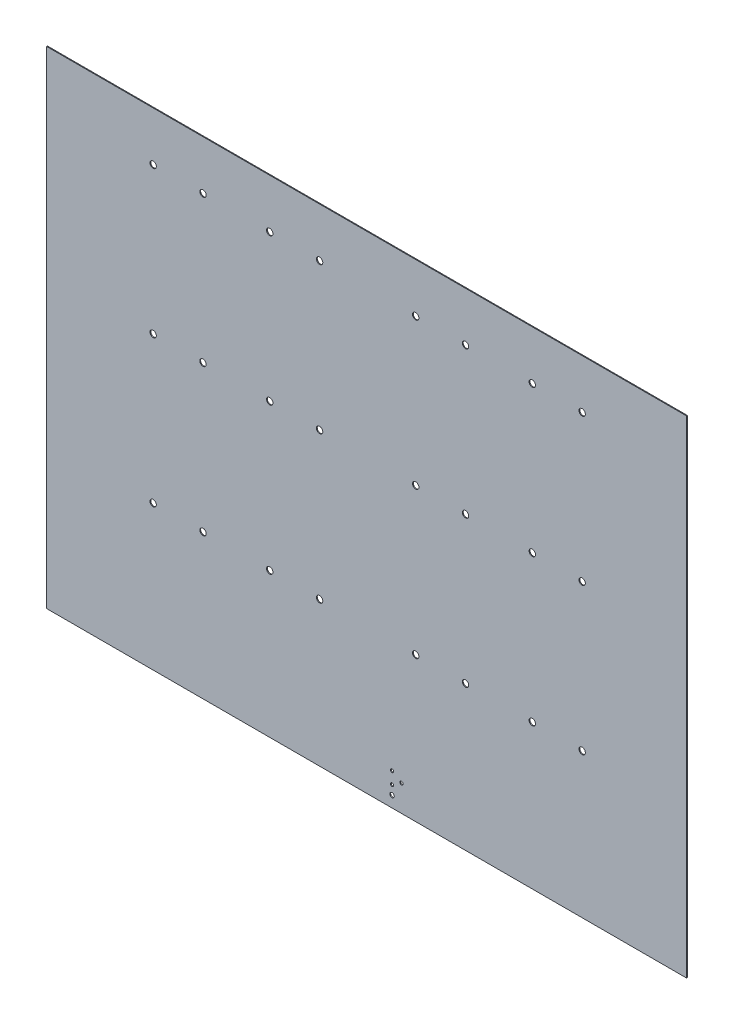
ISO-10303-21;
HEADER;
FILE_DESCRIPTION(('STEP AP214'),'2;1');
FILE_NAME('part.step','',(''),(''),'','','');
FILE_SCHEMA(('AUTOMOTIVE_DESIGN { 1 0 10303 214 1 1 1 1 }'));
ENDSEC;
DATA;
#1=APPLICATION_CONTEXT('core data for automotive mechanical design processes');
#2=APPLICATION_PROTOCOL_DEFINITION('international standard','automotive_design',2000,#1);
#3=PRODUCT_CONTEXT('',#1,'mechanical');
#4=PRODUCT('Part','Part','',(#3));
#5=PRODUCT_RELATED_PRODUCT_CATEGORY('part','',(#4));
#6=PRODUCT_DEFINITION_FORMATION('','',#4);
#7=PRODUCT_DEFINITION_CONTEXT('part definition',#1,'design');
#8=PRODUCT_DEFINITION('design','',#6,#7);
#9=PRODUCT_DEFINITION_SHAPE('','',#8);
#10=(LENGTH_UNIT() NAMED_UNIT(*) SI_UNIT(.MILLI.,.METRE.));
#11=(NAMED_UNIT(*) PLANE_ANGLE_UNIT() SI_UNIT($,.RADIAN.));
#12=(NAMED_UNIT(*) SI_UNIT($,.STERADIAN.) SOLID_ANGLE_UNIT());
#13=UNCERTAINTY_MEASURE_WITH_UNIT(LENGTH_MEASURE(1.E-05),#10,'distance_accuracy_value','');
#14=(GEOMETRIC_REPRESENTATION_CONTEXT(3) GLOBAL_UNCERTAINTY_ASSIGNED_CONTEXT((#13)) GLOBAL_UNIT_ASSIGNED_CONTEXT((#10,
#11,#12)) REPRESENTATION_CONTEXT('',''));
#15=CARTESIAN_POINT('',(0.,0.,0.));
#16=DIRECTION('',(0.,0.,1.));
#17=DIRECTION('',(1.,0.,0.));
#18=AXIS2_PLACEMENT_3D('',#15,#16,#17);
#19=CARTESIAN_POINT('',(50.8,50.8,0.));
#20=DIRECTION('',(0.,0.,-1.));
#21=DIRECTION('',(-1.,0.,0.));
#22=AXIS2_PLACEMENT_3D('',#19,#20,#21);
#23=PLANE('',#22);
#24=CARTESIAN_POINT('',(317.5889,268.8971,0.));
#25=DIRECTION('',(0.,0.,-1.));
#26=DIRECTION('',(-1.,0.,0.));
#27=AXIS2_PLACEMENT_3D('',#24,#25,#26);
#28=CIRCLE('',#27,1.5875);
#29=CARTESIAN_POINT('',(316.0014,268.8971,0.));
#30=VERTEX_POINT('',#29);
#31=EDGE_CURVE('E161',#30,#30,#28,.F.);
#32=ORIENTED_EDGE('',*,*,#31,.T.);
#33=EDGE_LOOP('',(#32));
#34=FACE_BOUND('',#33,.T.);
#35=CARTESIAN_POINT('',(292.7477,268.8971,0.));
#36=DIRECTION('',(0.,0.,-1.));
#37=DIRECTION('',(-1.,0.,0.));
#38=AXIS2_PLACEMENT_3D('',#35,#36,#37);
#39=CIRCLE('',#38,1.5875);
#40=CARTESIAN_POINT('',(291.1602,268.8971,0.));
#41=VERTEX_POINT('',#40);
#42=EDGE_CURVE('E164',#41,#41,#39,.F.);
#43=ORIENTED_EDGE('',*,*,#42,.T.);
#44=EDGE_LOOP('',(#43));
#45=FACE_BOUND('',#44,.T.);
#46=CARTESIAN_POINT('',(317.5889,195.8721,0.));
#47=DIRECTION('',(0.,0.,-1.));
#48=DIRECTION('',(-1.,0.,0.));
#49=AXIS2_PLACEMENT_3D('',#46,#47,#48);
#50=CIRCLE('',#49,1.5875);
#51=CARTESIAN_POINT('',(316.0014,195.8721,0.));
#52=VERTEX_POINT('',#51);
#53=EDGE_CURVE('E167',#52,#52,#50,.F.);
#54=ORIENTED_EDGE('',*,*,#53,.T.);
#55=EDGE_LOOP('',(#54));
#56=FACE_BOUND('',#55,.T.);
#57=CARTESIAN_POINT('',(292.7477,195.8721,0.));
#58=DIRECTION('',(0.,0.,-1.));
#59=DIRECTION('',(-1.,0.,0.));
#60=AXIS2_PLACEMENT_3D('',#57,#58,#59);
#61=CIRCLE('',#60,1.5875);
#62=CARTESIAN_POINT('',(291.1602,195.8721,0.));
#63=VERTEX_POINT('',#62);
#64=EDGE_CURVE('E170',#63,#63,#61,.F.);
#65=ORIENTED_EDGE('',*,*,#64,.T.);
#66=EDGE_LOOP('',(#65));
#67=FACE_BOUND('',#66,.T.);
#68=CARTESIAN_POINT('',(259.49402,268.8971,0.));
#69=DIRECTION('',(0.,0.,-1.));
#70=DIRECTION('',(-1.,0.,0.));
#71=AXIS2_PLACEMENT_3D('',#68,#69,#70);
#72=CIRCLE('',#71,1.5875);
#73=CARTESIAN_POINT('',(257.90652,268.8971,0.));
#74=VERTEX_POINT('',#73);
#75=EDGE_CURVE('E173',#74,#74,#72,.F.);
#76=ORIENTED_EDGE('',*,*,#75,.T.);
#77=EDGE_LOOP('',(#76));
#78=FACE_BOUND('',#77,.T.);
#79=CARTESIAN_POINT('',(234.65282,268.8971,0.));
#80=DIRECTION('',(0.,0.,-1.));
#81=DIRECTION('',(-1.,0.,0.));
#82=AXIS2_PLACEMENT_3D('',#79,#80,#81);
#83=CIRCLE('',#82,1.5875);
#84=CARTESIAN_POINT('',(233.06532,268.8971,0.));
#85=VERTEX_POINT('',#84);
#86=EDGE_CURVE('E176',#85,#85,#83,.F.);
#87=ORIENTED_EDGE('',*,*,#86,.T.);
#88=EDGE_LOOP('',(#87));
#89=FACE_BOUND('',#88,.T.);
#90=CARTESIAN_POINT('',(259.49402,195.8721,0.));
#91=DIRECTION('',(0.,0.,-1.));
#92=DIRECTION('',(-1.,0.,0.));
#93=AXIS2_PLACEMENT_3D('',#90,#91,#92);
#94=CIRCLE('',#93,1.5875);
#95=CARTESIAN_POINT('',(257.90652,195.8721,0.));
#96=VERTEX_POINT('',#95);
#97=EDGE_CURVE('E179',#96,#96,#94,.F.);
#98=ORIENTED_EDGE('',*,*,#97,.T.);
#99=EDGE_LOOP('',(#98));
#100=FACE_BOUND('',#99,.T.);
#101=CARTESIAN_POINT('',(259.49402,122.8471,0.));
#102=DIRECTION('',(0.,0.,-1.));
#103=DIRECTION('',(-1.,0.,0.));
#104=AXIS2_PLACEMENT_3D('',#101,#102,#103);
#105=CIRCLE('',#104,1.5875);
#106=CARTESIAN_POINT('',(257.90652,122.8471,0.));
#107=VERTEX_POINT('',#106);
#108=EDGE_CURVE('E182',#107,#107,#105,.F.);
#109=ORIENTED_EDGE('',*,*,#108,.T.);
#110=EDGE_LOOP('',(#109));
#111=FACE_BOUND('',#110,.T.);
#112=CARTESIAN_POINT('',(234.65282,195.8721,0.));
#113=DIRECTION('',(0.,0.,-1.));
#114=DIRECTION('',(-1.,0.,0.));
#115=AXIS2_PLACEMENT_3D('',#112,#113,#114);
#116=CIRCLE('',#115,1.5875);
#117=CARTESIAN_POINT('',(233.06532,195.8721,0.));
#118=VERTEX_POINT('',#117);
#119=EDGE_CURVE('E185',#118,#118,#116,.F.);
#120=ORIENTED_EDGE('',*,*,#119,.T.);
#121=EDGE_LOOP('',(#120));
#122=FACE_BOUND('',#121,.T.);
#123=CARTESIAN_POINT('',(317.5889,122.8471,0.));
#124=DIRECTION('',(0.,0.,-1.));
#125=DIRECTION('',(-1.,0.,0.));
#126=AXIS2_PLACEMENT_3D('',#123,#124,#125);
#127=CIRCLE('',#126,1.5875);
#128=CARTESIAN_POINT('',(316.0014,122.8471,0.));
#129=VERTEX_POINT('',#128);
#130=EDGE_CURVE('E188',#129,#129,#127,.F.);
#131=ORIENTED_EDGE('',*,*,#130,.T.);
#132=EDGE_LOOP('',(#131));
#133=FACE_BOUND('',#132,.T.);
#134=CARTESIAN_POINT('',(292.7477,122.8471,0.));
#135=DIRECTION('',(0.,0.,-1.));
#136=DIRECTION('',(-1.,0.,0.));
#137=AXIS2_PLACEMENT_3D('',#134,#135,#136);
#138=CIRCLE('',#137,1.5875);
#139=CARTESIAN_POINT('',(291.1602,122.8471,0.));
#140=VERTEX_POINT('',#139);
#141=EDGE_CURVE('E191',#140,#140,#138,.F.);
#142=ORIENTED_EDGE('',*,*,#141,.T.);
#143=EDGE_LOOP('',(#142));
#144=FACE_BOUND('',#143,.T.);
#145=CARTESIAN_POINT('',(234.65282,122.8471,0.));
#146=DIRECTION('',(0.,0.,-1.));
#147=DIRECTION('',(-1.,0.,0.));
#148=AXIS2_PLACEMENT_3D('',#145,#146,#147);
#149=CIRCLE('',#148,1.5875);
#150=CARTESIAN_POINT('',(233.06532,122.8471,0.));
#151=VERTEX_POINT('',#150);
#152=EDGE_CURVE('E194',#151,#151,#149,.F.);
#153=ORIENTED_EDGE('',*,*,#152,.T.);
#154=EDGE_LOOP('',(#153));
#155=FACE_BOUND('',#154,.T.);
#156=CARTESIAN_POINT('',(227.5713,63.881,0.));
#157=DIRECTION('',(0.,0.,-1.));
#158=DIRECTION('',(-1.,0.,0.));
#159=AXIS2_PLACEMENT_3D('',#156,#157,#158);
#160=CIRCLE('',#159,0.8001);
#161=CARTESIAN_POINT('',(226.7712,63.881,0.));
#162=VERTEX_POINT('',#161);
#163=EDGE_CURVE('E197',#162,#162,#160,.F.);
#164=ORIENTED_EDGE('',*,*,#163,.T.);
#165=EDGE_LOOP('',(#164));
#166=FACE_BOUND('',#165,.T.);
#167=CARTESIAN_POINT('',(222.8723,60.8838,0.));
#168=DIRECTION('',(0.,0.,-1.));
#169=DIRECTION('',(-1.,0.,0.));
#170=AXIS2_PLACEMENT_3D('',#167,#168,#169);
#171=CIRCLE('',#170,0.8001);
#172=CARTESIAN_POINT('',(222.0722,60.8838,0.));
#173=VERTEX_POINT('',#172);
#174=EDGE_CURVE('E200',#173,#173,#171,.F.);
#175=ORIENTED_EDGE('',*,*,#174,.T.);
#176=EDGE_LOOP('',(#175));
#177=FACE_BOUND('',#176,.T.);
#178=CARTESIAN_POINT('',(186.77255,268.8971,0.));
#179=DIRECTION('',(0.,0.,-1.));
#180=DIRECTION('',(-1.,0.,0.));
#181=AXIS2_PLACEMENT_3D('',#178,#179,#180);
#182=CIRCLE('',#181,1.5875);
#183=CARTESIAN_POINT('',(185.18505,268.8971,0.));
#184=VERTEX_POINT('',#183);
#185=EDGE_CURVE('E203',#184,#184,#182,.F.);
#186=ORIENTED_EDGE('',*,*,#185,.T.);
#187=EDGE_LOOP('',(#186));
#188=FACE_BOUND('',#187,.T.);
#189=CARTESIAN_POINT('',(161.93135,268.8971,0.));
#190=DIRECTION('',(0.,0.,-1.));
#191=DIRECTION('',(-1.,0.,0.));
#192=AXIS2_PLACEMENT_3D('',#189,#190,#191);
#193=CIRCLE('',#192,1.5875);
#194=CARTESIAN_POINT('',(160.34385,268.8971,0.));
#195=VERTEX_POINT('',#194);
#196=EDGE_CURVE('E206',#195,#195,#193,.F.);
#197=ORIENTED_EDGE('',*,*,#196,.T.);
#198=EDGE_LOOP('',(#197));
#199=FACE_BOUND('',#198,.T.);
#200=CARTESIAN_POINT('',(186.77255,195.8721,0.));
#201=DIRECTION('',(0.,0.,-1.));
#202=DIRECTION('',(-1.,0.,0.));
#203=AXIS2_PLACEMENT_3D('',#200,#201,#202);
#204=CIRCLE('',#203,1.5875);
#205=CARTESIAN_POINT('',(185.18505,195.8721,0.));
#206=VERTEX_POINT('',#205);
#207=EDGE_CURVE('E209',#206,#206,#204,.F.);
#208=ORIENTED_EDGE('',*,*,#207,.T.);
#209=EDGE_LOOP('',(#208));
#210=FACE_BOUND('',#209,.T.);
#211=CARTESIAN_POINT('',(161.93135,195.8721,0.));
#212=DIRECTION('',(0.,0.,-1.));
#213=DIRECTION('',(-1.,0.,0.));
#214=AXIS2_PLACEMENT_3D('',#211,#212,#213);
#215=CIRCLE('',#214,1.5875);
#216=CARTESIAN_POINT('',(160.34385,195.8721,0.));
#217=VERTEX_POINT('',#216);
#218=EDGE_CURVE('E212',#217,#217,#215,.F.);
#219=ORIENTED_EDGE('',*,*,#218,.T.);
#220=EDGE_LOOP('',(#219));
#221=FACE_BOUND('',#220,.T.);
#222=CARTESIAN_POINT('',(128.67767,268.8971,0.));
#223=DIRECTION('',(0.,0.,-1.));
#224=DIRECTION('',(-1.,0.,0.));
#225=AXIS2_PLACEMENT_3D('',#222,#223,#224);
#226=CIRCLE('',#225,1.5875);
#227=CARTESIAN_POINT('',(127.09017,268.8971,0.));
#228=VERTEX_POINT('',#227);
#229=EDGE_CURVE('E215',#228,#228,#226,.F.);
#230=ORIENTED_EDGE('',*,*,#229,.T.);
#231=EDGE_LOOP('',(#230));
#232=FACE_BOUND('',#231,.T.);
#233=CARTESIAN_POINT('',(103.83647,268.8971,0.));
#234=DIRECTION('',(0.,0.,-1.));
#235=DIRECTION('',(-1.,0.,0.));
#236=AXIS2_PLACEMENT_3D('',#233,#234,#235);
#237=CIRCLE('',#236,1.5875);
#238=CARTESIAN_POINT('',(102.24897,268.8971,0.));
#239=VERTEX_POINT('',#238);
#240=EDGE_CURVE('E218',#239,#239,#237,.F.);
#241=ORIENTED_EDGE('',*,*,#240,.T.);
#242=EDGE_LOOP('',(#241));
#243=FACE_BOUND('',#242,.T.);
#244=CARTESIAN_POINT('',(128.67767,195.8721,0.));
#245=DIRECTION('',(0.,0.,-1.));
#246=DIRECTION('',(-1.,0.,0.));
#247=AXIS2_PLACEMENT_3D('',#244,#245,#246);
#248=CIRCLE('',#247,1.5875);
#249=CARTESIAN_POINT('',(127.09017,195.8721,0.));
#250=VERTEX_POINT('',#249);
#251=EDGE_CURVE('E221',#250,#250,#248,.F.);
#252=ORIENTED_EDGE('',*,*,#251,.T.);
#253=EDGE_LOOP('',(#252));
#254=FACE_BOUND('',#253,.T.);
#255=CARTESIAN_POINT('',(186.77255,122.8471,0.));
#256=DIRECTION('',(0.,0.,-1.));
#257=DIRECTION('',(-1.,0.,0.));
#258=AXIS2_PLACEMENT_3D('',#255,#256,#257);
#259=CIRCLE('',#258,1.5875);
#260=CARTESIAN_POINT('',(185.18505,122.8471,0.));
#261=VERTEX_POINT('',#260);
#262=EDGE_CURVE('E224',#261,#261,#259,.F.);
#263=ORIENTED_EDGE('',*,*,#262,.T.);
#264=EDGE_LOOP('',(#263));
#265=FACE_BOUND('',#264,.T.);
#266=CARTESIAN_POINT('',(161.93135,122.8471,0.));
#267=DIRECTION('',(0.,0.,-1.));
#268=DIRECTION('',(-1.,0.,0.));
#269=AXIS2_PLACEMENT_3D('',#266,#267,#268);
#270=CIRCLE('',#269,1.5875);
#271=CARTESIAN_POINT('',(160.34385,122.8471,0.));
#272=VERTEX_POINT('',#271);
#273=EDGE_CURVE('E227',#272,#272,#270,.F.);
#274=ORIENTED_EDGE('',*,*,#273,.T.);
#275=EDGE_LOOP('',(#274));
#276=FACE_BOUND('',#275,.T.);
#277=CARTESIAN_POINT('',(222.8723,66.8782,0.));
#278=DIRECTION('',(0.,0.,-1.));
#279=DIRECTION('',(-1.,0.,0.));
#280=AXIS2_PLACEMENT_3D('',#277,#278,#279);
#281=CIRCLE('',#280,0.8001);
#282=CARTESIAN_POINT('',(222.0722,66.8782,0.));
#283=VERTEX_POINT('',#282);
#284=EDGE_CURVE('E230',#283,#283,#281,.F.);
#285=ORIENTED_EDGE('',*,*,#284,.T.);
#286=EDGE_LOOP('',(#285));
#287=FACE_BOUND('',#286,.T.);
#288=CARTESIAN_POINT('',(222.8723,56.3626,0.));
#289=DIRECTION('',(0.,0.,-1.));
#290=DIRECTION('',(-1.,0.,0.));
#291=AXIS2_PLACEMENT_3D('',#288,#289,#290);
#292=CIRCLE('',#291,1.1049);
#293=CARTESIAN_POINT('',(221.7674,56.3626,0.));
#294=VERTEX_POINT('',#293);
#295=EDGE_CURVE('E233',#294,#294,#292,.F.);
#296=ORIENTED_EDGE('',*,*,#295,.T.);
#297=EDGE_LOOP('',(#296));
#298=FACE_BOUND('',#297,.T.);
#299=CARTESIAN_POINT('',(128.67767,122.8471,0.));
#300=DIRECTION('',(0.,0.,-1.));
#301=DIRECTION('',(-1.,0.,0.));
#302=AXIS2_PLACEMENT_3D('',#299,#300,#301);
#303=CIRCLE('',#302,1.5875);
#304=CARTESIAN_POINT('',(127.09017,122.8471,0.));
#305=VERTEX_POINT('',#304);
#306=EDGE_CURVE('E236',#305,#305,#303,.F.);
#307=ORIENTED_EDGE('',*,*,#306,.T.);
#308=EDGE_LOOP('',(#307));
#309=FACE_BOUND('',#308,.T.);
#310=CARTESIAN_POINT('',(103.83647,195.8721,0.));
#311=DIRECTION('',(0.,0.,-1.));
#312=DIRECTION('',(-1.,0.,0.));
#313=AXIS2_PLACEMENT_3D('',#310,#311,#312);
#314=CIRCLE('',#313,1.5875);
#315=CARTESIAN_POINT('',(102.24897,195.8721,0.));
#316=VERTEX_POINT('',#315);
#317=EDGE_CURVE('E238',#316,#316,#314,.F.);
#318=ORIENTED_EDGE('',*,*,#317,.T.);
#319=EDGE_LOOP('',(#318));
#320=FACE_BOUND('',#319,.T.);
#321=CARTESIAN_POINT('',(103.83647,122.8471,0.));
#322=DIRECTION('',(0.,0.,-1.));
#323=DIRECTION('',(-1.,0.,0.));
#324=AXIS2_PLACEMENT_3D('',#321,#322,#323);
#325=CIRCLE('',#324,1.5875);
#326=CARTESIAN_POINT('',(102.24897,122.8471,0.));
#327=VERTEX_POINT('',#326);
#328=EDGE_CURVE('E20',#327,#327,#325,.F.);
#329=ORIENTED_EDGE('',*,*,#328,.T.);
#330=EDGE_LOOP('',(#329));
#331=FACE_BOUND('',#330,.T.);
#332=DIRECTION('',(0.,1.,0.));
#333=VECTOR('',#332,1.);
#334=CARTESIAN_POINT('',(369.57,50.8,0.));
#335=LINE('',#334,#333);
#336=CARTESIAN_POINT('',(369.57,293.37,0.));
#337=VERTEX_POINT('',#336);
#338=CARTESIAN_POINT('',(369.57,50.8,0.));
#339=VERTEX_POINT('',#338);
#340=EDGE_CURVE('E252',#337,#339,#335,.F.);
#341=ORIENTED_EDGE('',*,*,#340,.T.);
#342=DIRECTION('',(1.,0.,0.));
#343=VECTOR('',#342,1.);
#344=CARTESIAN_POINT('',(50.8,50.8,0.));
#345=LINE('',#344,#343);
#346=CARTESIAN_POINT('',(50.8,50.8,0.));
#347=VERTEX_POINT('',#346);
#348=EDGE_CURVE('E60',#339,#347,#345,.F.);
#349=ORIENTED_EDGE('',*,*,#348,.T.);
#350=DIRECTION('',(0.,1.,0.));
#351=VECTOR('',#350,1.);
#352=CARTESIAN_POINT('',(50.8,293.37,0.));
#353=LINE('',#352,#351);
#354=CARTESIAN_POINT('',(50.8,293.37,0.));
#355=VERTEX_POINT('',#354);
#356=EDGE_CURVE('E59',#347,#355,#353,.T.);
#357=ORIENTED_EDGE('',*,*,#356,.T.);
#358=DIRECTION('',(1.,0.,0.));
#359=VECTOR('',#358,1.);
#360=CARTESIAN_POINT('',(369.57,293.37,0.));
#361=LINE('',#360,#359);
#362=EDGE_CURVE('E56',#355,#337,#361,.T.);
#363=ORIENTED_EDGE('',*,*,#362,.T.);
#364=EDGE_LOOP('',(#341,#349,#357,#363));
#365=FACE_BOUND('',#364,.T.);
#366=ADVANCED_FACE('F17',(#34,#45,#56,#67,#78,#89,#100,#111,#122,#133,#144,#155,#166,#177,#188,
#199,#210,#221,#232,#243,#254,#265,#276,#287,#298,#309,#320,#331,#365),#23,.T.);
#367=CARTESIAN_POINT('',(50.8,293.37,0.));
#368=DIRECTION('',(1.,0.,0.));
#369=DIRECTION('',(0.,0.,-1.));
#370=AXIS2_PLACEMENT_3D('',#367,#368,#369);
#371=PLANE('',#370);
#372=DIRECTION('',(0.,0.,1.));
#373=VECTOR('',#372,1.);
#374=CARTESIAN_POINT('',(50.8,50.8,0.));
#375=LINE('',#374,#373);
#376=CARTESIAN_POINT('',(50.8,50.8,0.41148));
#377=VERTEX_POINT('',#376);
#378=EDGE_CURVE('E246',#347,#377,#375,.T.);
#379=ORIENTED_EDGE('',*,*,#378,.T.);
#380=DIRECTION('',(0.,1.,0.));
#381=VECTOR('',#380,1.);
#382=CARTESIAN_POINT('',(50.8,50.8,0.41148));
#383=LINE('',#382,#381);
#384=CARTESIAN_POINT('',(50.8,293.37,0.41148));
#385=VERTEX_POINT('',#384);
#386=EDGE_CURVE('E76',#377,#385,#383,.T.);
#387=ORIENTED_EDGE('',*,*,#386,.T.);
#388=DIRECTION('',(0.,0.,-1.));
#389=VECTOR('',#388,1.);
#390=CARTESIAN_POINT('',(50.8,293.37,0.));
#391=LINE('',#390,#389);
#392=EDGE_CURVE('E65',#385,#355,#391,.T.);
#393=ORIENTED_EDGE('',*,*,#392,.T.);
#394=ORIENTED_EDGE('',*,*,#356,.F.);
#395=EDGE_LOOP('',(#379,#387,#393,#394));
#396=FACE_BOUND('',#395,.T.);
#397=ADVANCED_FACE('F75',(#396),#371,.F.);
#398=CARTESIAN_POINT('',(369.57,293.37,0.));
#399=DIRECTION('',(0.,-1.,0.));
#400=DIRECTION('',(0.,0.,-1.));
#401=AXIS2_PLACEMENT_3D('',#398,#399,#400);
#402=PLANE('',#401);
#403=ORIENTED_EDGE('',*,*,#392,.F.);
#404=DIRECTION('',(-1.,0.,0.));
#405=VECTOR('',#404,1.);
#406=CARTESIAN_POINT('',(50.8,293.37,0.41148));
#407=LINE('',#406,#405);
#408=CARTESIAN_POINT('',(369.57,293.37,0.41148));
#409=VERTEX_POINT('',#408);
#410=EDGE_CURVE('E260',#385,#409,#407,.F.);
#411=ORIENTED_EDGE('',*,*,#410,.T.);
#412=DIRECTION('',(0.,0.,1.));
#413=VECTOR('',#412,1.);
#414=CARTESIAN_POINT('',(369.57,293.37,0.));
#415=LINE('',#414,#413);
#416=EDGE_CURVE('E72',#409,#337,#415,.F.);
#417=ORIENTED_EDGE('',*,*,#416,.T.);
#418=ORIENTED_EDGE('',*,*,#362,.F.);
#419=EDGE_LOOP('',(#403,#411,#417,#418));
#420=FACE_BOUND('',#419,.T.);
#421=ADVANCED_FACE('F69',(#420),#402,.F.);
#422=CARTESIAN_POINT('',(369.57,50.8,0.));
#423=DIRECTION('',(-1.,0.,0.));
#424=DIRECTION('',(0.,0.,1.));
#425=AXIS2_PLACEMENT_3D('',#422,#423,#424);
#426=PLANE('',#425);
#427=ORIENTED_EDGE('',*,*,#416,.F.);
#428=DIRECTION('',(0.,1.,0.));
#429=VECTOR('',#428,1.);
#430=CARTESIAN_POINT('',(369.57,50.8,0.41148));
#431=LINE('',#430,#429);
#432=CARTESIAN_POINT('',(369.57,50.8,0.41148));
#433=VERTEX_POINT('',#432);
#434=EDGE_CURVE('E258',#409,#433,#431,.F.);
#435=ORIENTED_EDGE('',*,*,#434,.T.);
#436=DIRECTION('',(0.,0.,1.));
#437=VECTOR('',#436,1.);
#438=CARTESIAN_POINT('',(369.57,50.8,0.));
#439=LINE('',#438,#437);
#440=EDGE_CURVE('E35',#433,#339,#439,.F.);
#441=ORIENTED_EDGE('',*,*,#440,.T.);
#442=ORIENTED_EDGE('',*,*,#340,.F.);
#443=EDGE_LOOP('',(#427,#435,#441,#442));
#444=FACE_BOUND('',#443,.T.);
#445=ADVANCED_FACE('F256',(#444),#426,.F.);
#446=CARTESIAN_POINT('',(50.8,50.8,0.));
#447=DIRECTION('',(0.,1.,0.));
#448=DIRECTION('',(0.,0.,1.));
#449=AXIS2_PLACEMENT_3D('',#446,#447,#448);
#450=PLANE('',#449);
#451=ORIENTED_EDGE('',*,*,#440,.F.);
#452=DIRECTION('',(-1.,0.,0.));
#453=VECTOR('',#452,1.);
#454=CARTESIAN_POINT('',(50.8,50.8,0.41148));
#455=LINE('',#454,#453);
#456=EDGE_CURVE('E160',#433,#377,#455,.T.);
#457=ORIENTED_EDGE('',*,*,#456,.T.);
#458=ORIENTED_EDGE('',*,*,#378,.F.);
#459=ORIENTED_EDGE('',*,*,#348,.F.);
#460=EDGE_LOOP('',(#451,#457,#458,#459));
#461=FACE_BOUND('',#460,.T.);
#462=ADVANCED_FACE('F254',(#461),#450,.F.);
#463=CARTESIAN_POINT('',(103.83647,122.8471,0.));
#464=DIRECTION('',(0.,0.,-1.));
#465=DIRECTION('',(-1.,0.,0.));
#466=AXIS2_PLACEMENT_3D('',#463,#464,#465);
#467=CYLINDRICAL_SURFACE('',#466,1.5875);
#468=CARTESIAN_POINT('',(103.83647,122.8471,0.41148));
#469=DIRECTION('',(0.,0.,-1.));
#470=DIRECTION('',(-1.,0.,0.));
#471=AXIS2_PLACEMENT_3D('',#468,#469,#470);
#472=CIRCLE('',#471,1.5875);
#473=CARTESIAN_POINT('',(102.24897,122.8471,0.41148));
#474=VERTEX_POINT('',#473);
#475=EDGE_CURVE('E157',#474,#474,#472,.F.);
#476=ORIENTED_EDGE('',*,*,#475,.T.);
#477=EDGE_LOOP('',(#476));
#478=FACE_BOUND('',#477,.T.);
#479=ORIENTED_EDGE('',*,*,#328,.F.);
#480=EDGE_LOOP('',(#479));
#481=FACE_BOUND('',#480,.T.);
#482=ADVANCED_FACE('F380',(#478,#481),#467,.F.);
#483=CARTESIAN_POINT('',(103.83647,195.8721,0.));
#484=DIRECTION('',(0.,0.,-1.));
#485=DIRECTION('',(-1.,0.,0.));
#486=AXIS2_PLACEMENT_3D('',#483,#484,#485);
#487=CYLINDRICAL_SURFACE('',#486,1.5875);
#488=CARTESIAN_POINT('',(103.83647,195.8721,0.41148));
#489=DIRECTION('',(0.,0.,-1.));
#490=DIRECTION('',(-1.,0.,0.));
#491=AXIS2_PLACEMENT_3D('',#488,#489,#490);
#492=CIRCLE('',#491,1.5875);
#493=CARTESIAN_POINT('',(102.24897,195.8721,0.41148));
#494=VERTEX_POINT('',#493);
#495=EDGE_CURVE('E154',#494,#494,#492,.F.);
#496=ORIENTED_EDGE('',*,*,#495,.T.);
#497=EDGE_LOOP('',(#496));
#498=FACE_BOUND('',#497,.T.);
#499=ORIENTED_EDGE('',*,*,#317,.F.);
#500=EDGE_LOOP('',(#499));
#501=FACE_BOUND('',#500,.T.);
#502=ADVANCED_FACE('F376',(#498,#501),#487,.F.);
#503=CARTESIAN_POINT('',(128.67767,122.8471,0.));
#504=DIRECTION('',(0.,0.,-1.));
#505=DIRECTION('',(-1.,0.,0.));
#506=AXIS2_PLACEMENT_3D('',#503,#504,#505);
#507=CYLINDRICAL_SURFACE('',#506,1.5875);
#508=CARTESIAN_POINT('',(128.67767,122.8471,0.41148));
#509=DIRECTION('',(0.,0.,-1.));
#510=DIRECTION('',(-1.,0.,0.));
#511=AXIS2_PLACEMENT_3D('',#508,#509,#510);
#512=CIRCLE('',#511,1.5875);
#513=CARTESIAN_POINT('',(127.09017,122.8471,0.41148));
#514=VERTEX_POINT('',#513);
#515=EDGE_CURVE('E151',#514,#514,#512,.F.);
#516=ORIENTED_EDGE('',*,*,#515,.T.);
#517=EDGE_LOOP('',(#516));
#518=FACE_BOUND('',#517,.T.);
#519=ORIENTED_EDGE('',*,*,#306,.F.);
#520=EDGE_LOOP('',(#519));
#521=FACE_BOUND('',#520,.T.);
#522=ADVANCED_FACE('F372',(#518,#521),#507,.F.);
#523=CARTESIAN_POINT('',(222.8723,56.3626,0.));
#524=DIRECTION('',(0.,0.,-1.));
#525=DIRECTION('',(-1.,0.,0.));
#526=AXIS2_PLACEMENT_3D('',#523,#524,#525);
#527=CYLINDRICAL_SURFACE('',#526,1.1049);
#528=CARTESIAN_POINT('',(222.8723,56.3626,0.41148));
#529=DIRECTION('',(0.,0.,-1.));
#530=DIRECTION('',(-1.,0.,0.));
#531=AXIS2_PLACEMENT_3D('',#528,#529,#530);
#532=CIRCLE('',#531,1.1049);
#533=CARTESIAN_POINT('',(221.7674,56.3626,0.41148));
#534=VERTEX_POINT('',#533);
#535=EDGE_CURVE('E148',#534,#534,#532,.F.);
#536=ORIENTED_EDGE('',*,*,#535,.T.);
#537=EDGE_LOOP('',(#536));
#538=FACE_BOUND('',#537,.T.);
#539=ORIENTED_EDGE('',*,*,#295,.F.);
#540=EDGE_LOOP('',(#539));
#541=FACE_BOUND('',#540,.T.);
#542=ADVANCED_FACE('F368',(#538,#541),#527,.F.);
#543=CARTESIAN_POINT('',(222.8723,66.8782,0.));
#544=DIRECTION('',(0.,0.,-1.));
#545=DIRECTION('',(-1.,0.,0.));
#546=AXIS2_PLACEMENT_3D('',#543,#544,#545);
#547=CYLINDRICAL_SURFACE('',#546,0.8001);
#548=CARTESIAN_POINT('',(222.8723,66.8782,0.41148));
#549=DIRECTION('',(0.,0.,-1.));
#550=DIRECTION('',(-1.,0.,0.));
#551=AXIS2_PLACEMENT_3D('',#548,#549,#550);
#552=CIRCLE('',#551,0.8001);
#553=CARTESIAN_POINT('',(222.0722,66.8782,0.41148));
#554=VERTEX_POINT('',#553);
#555=EDGE_CURVE('E145',#554,#554,#552,.F.);
#556=ORIENTED_EDGE('',*,*,#555,.T.);
#557=EDGE_LOOP('',(#556));
#558=FACE_BOUND('',#557,.T.);
#559=ORIENTED_EDGE('',*,*,#284,.F.);
#560=EDGE_LOOP('',(#559));
#561=FACE_BOUND('',#560,.T.);
#562=ADVANCED_FACE('F364',(#558,#561),#547,.F.);
#563=CARTESIAN_POINT('',(161.93135,122.8471,0.));
#564=DIRECTION('',(0.,0.,-1.));
#565=DIRECTION('',(-1.,0.,0.));
#566=AXIS2_PLACEMENT_3D('',#563,#564,#565);
#567=CYLINDRICAL_SURFACE('',#566,1.5875);
#568=CARTESIAN_POINT('',(161.93135,122.8471,0.41148));
#569=DIRECTION('',(0.,0.,-1.));
#570=DIRECTION('',(-1.,0.,0.));
#571=AXIS2_PLACEMENT_3D('',#568,#569,#570);
#572=CIRCLE('',#571,1.5875);
#573=CARTESIAN_POINT('',(160.34385,122.8471,0.41148));
#574=VERTEX_POINT('',#573);
#575=EDGE_CURVE('E142',#574,#574,#572,.F.);
#576=ORIENTED_EDGE('',*,*,#575,.T.);
#577=EDGE_LOOP('',(#576));
#578=FACE_BOUND('',#577,.T.);
#579=ORIENTED_EDGE('',*,*,#273,.F.);
#580=EDGE_LOOP('',(#579));
#581=FACE_BOUND('',#580,.T.);
#582=ADVANCED_FACE('F360',(#578,#581),#567,.F.);
#583=CARTESIAN_POINT('',(186.77255,122.8471,0.));
#584=DIRECTION('',(0.,0.,-1.));
#585=DIRECTION('',(-1.,0.,0.));
#586=AXIS2_PLACEMENT_3D('',#583,#584,#585);
#587=CYLINDRICAL_SURFACE('',#586,1.5875);
#588=CARTESIAN_POINT('',(186.77255,122.8471,0.41148));
#589=DIRECTION('',(0.,0.,-1.));
#590=DIRECTION('',(-1.,0.,0.));
#591=AXIS2_PLACEMENT_3D('',#588,#589,#590);
#592=CIRCLE('',#591,1.5875);
#593=CARTESIAN_POINT('',(185.18505,122.8471,0.41148));
#594=VERTEX_POINT('',#593);
#595=EDGE_CURVE('E139',#594,#594,#592,.F.);
#596=ORIENTED_EDGE('',*,*,#595,.T.);
#597=EDGE_LOOP('',(#596));
#598=FACE_BOUND('',#597,.T.);
#599=ORIENTED_EDGE('',*,*,#262,.F.);
#600=EDGE_LOOP('',(#599));
#601=FACE_BOUND('',#600,.T.);
#602=ADVANCED_FACE('F356',(#598,#601),#587,.F.);
#603=CARTESIAN_POINT('',(128.67767,195.8721,0.));
#604=DIRECTION('',(0.,0.,-1.));
#605=DIRECTION('',(-1.,0.,0.));
#606=AXIS2_PLACEMENT_3D('',#603,#604,#605);
#607=CYLINDRICAL_SURFACE('',#606,1.5875);
#608=CARTESIAN_POINT('',(128.67767,195.8721,0.41148));
#609=DIRECTION('',(0.,0.,-1.));
#610=DIRECTION('',(-1.,0.,0.));
#611=AXIS2_PLACEMENT_3D('',#608,#609,#610);
#612=CIRCLE('',#611,1.5875);
#613=CARTESIAN_POINT('',(127.09017,195.8721,0.41148));
#614=VERTEX_POINT('',#613);
#615=EDGE_CURVE('E136',#614,#614,#612,.F.);
#616=ORIENTED_EDGE('',*,*,#615,.T.);
#617=EDGE_LOOP('',(#616));
#618=FACE_BOUND('',#617,.T.);
#619=ORIENTED_EDGE('',*,*,#251,.F.);
#620=EDGE_LOOP('',(#619));
#621=FACE_BOUND('',#620,.T.);
#622=ADVANCED_FACE('F352',(#618,#621),#607,.F.);
#623=CARTESIAN_POINT('',(103.83647,268.8971,0.));
#624=DIRECTION('',(0.,0.,-1.));
#625=DIRECTION('',(-1.,0.,0.));
#626=AXIS2_PLACEMENT_3D('',#623,#624,#625);
#627=CYLINDRICAL_SURFACE('',#626,1.5875);
#628=CARTESIAN_POINT('',(103.83647,268.8971,0.41148));
#629=DIRECTION('',(0.,0.,-1.));
#630=DIRECTION('',(-1.,0.,0.));
#631=AXIS2_PLACEMENT_3D('',#628,#629,#630);
#632=CIRCLE('',#631,1.5875);
#633=CARTESIAN_POINT('',(102.24897,268.8971,0.41148));
#634=VERTEX_POINT('',#633);
#635=EDGE_CURVE('E133',#634,#634,#632,.F.);
#636=ORIENTED_EDGE('',*,*,#635,.T.);
#637=EDGE_LOOP('',(#636));
#638=FACE_BOUND('',#637,.T.);
#639=ORIENTED_EDGE('',*,*,#240,.F.);
#640=EDGE_LOOP('',(#639));
#641=FACE_BOUND('',#640,.T.);
#642=ADVANCED_FACE('F348',(#638,#641),#627,.F.);
#643=CARTESIAN_POINT('',(128.67767,268.8971,0.));
#644=DIRECTION('',(0.,0.,-1.));
#645=DIRECTION('',(-1.,0.,0.));
#646=AXIS2_PLACEMENT_3D('',#643,#644,#645);
#647=CYLINDRICAL_SURFACE('',#646,1.5875);
#648=CARTESIAN_POINT('',(128.67767,268.8971,0.41148));
#649=DIRECTION('',(0.,0.,-1.));
#650=DIRECTION('',(-1.,0.,0.));
#651=AXIS2_PLACEMENT_3D('',#648,#649,#650);
#652=CIRCLE('',#651,1.5875);
#653=CARTESIAN_POINT('',(127.09017,268.8971,0.41148));
#654=VERTEX_POINT('',#653);
#655=EDGE_CURVE('E130',#654,#654,#652,.F.);
#656=ORIENTED_EDGE('',*,*,#655,.T.);
#657=EDGE_LOOP('',(#656));
#658=FACE_BOUND('',#657,.T.);
#659=ORIENTED_EDGE('',*,*,#229,.F.);
#660=EDGE_LOOP('',(#659));
#661=FACE_BOUND('',#660,.T.);
#662=ADVANCED_FACE('F344',(#658,#661),#647,.F.);
#663=CARTESIAN_POINT('',(161.93135,195.8721,0.));
#664=DIRECTION('',(0.,0.,-1.));
#665=DIRECTION('',(-1.,0.,0.));
#666=AXIS2_PLACEMENT_3D('',#663,#664,#665);
#667=CYLINDRICAL_SURFACE('',#666,1.5875);
#668=CARTESIAN_POINT('',(161.93135,195.8721,0.41148));
#669=DIRECTION('',(0.,0.,-1.));
#670=DIRECTION('',(-1.,0.,0.));
#671=AXIS2_PLACEMENT_3D('',#668,#669,#670);
#672=CIRCLE('',#671,1.5875);
#673=CARTESIAN_POINT('',(160.34385,195.8721,0.41148));
#674=VERTEX_POINT('',#673);
#675=EDGE_CURVE('E127',#674,#674,#672,.F.);
#676=ORIENTED_EDGE('',*,*,#675,.T.);
#677=EDGE_LOOP('',(#676));
#678=FACE_BOUND('',#677,.T.);
#679=ORIENTED_EDGE('',*,*,#218,.F.);
#680=EDGE_LOOP('',(#679));
#681=FACE_BOUND('',#680,.T.);
#682=ADVANCED_FACE('F340',(#678,#681),#667,.F.);
#683=CARTESIAN_POINT('',(186.77255,195.8721,0.));
#684=DIRECTION('',(0.,0.,-1.));
#685=DIRECTION('',(-1.,0.,0.));
#686=AXIS2_PLACEMENT_3D('',#683,#684,#685);
#687=CYLINDRICAL_SURFACE('',#686,1.5875);
#688=CARTESIAN_POINT('',(186.77255,195.8721,0.41148));
#689=DIRECTION('',(0.,0.,-1.));
#690=DIRECTION('',(-1.,0.,0.));
#691=AXIS2_PLACEMENT_3D('',#688,#689,#690);
#692=CIRCLE('',#691,1.5875);
#693=CARTESIAN_POINT('',(185.18505,195.8721,0.41148));
#694=VERTEX_POINT('',#693);
#695=EDGE_CURVE('E124',#694,#694,#692,.F.);
#696=ORIENTED_EDGE('',*,*,#695,.T.);
#697=EDGE_LOOP('',(#696));
#698=FACE_BOUND('',#697,.T.);
#699=ORIENTED_EDGE('',*,*,#207,.F.);
#700=EDGE_LOOP('',(#699));
#701=FACE_BOUND('',#700,.T.);
#702=ADVANCED_FACE('F336',(#698,#701),#687,.F.);
#703=CARTESIAN_POINT('',(161.93135,268.8971,0.));
#704=DIRECTION('',(0.,0.,-1.));
#705=DIRECTION('',(-1.,0.,0.));
#706=AXIS2_PLACEMENT_3D('',#703,#704,#705);
#707=CYLINDRICAL_SURFACE('',#706,1.5875);
#708=CARTESIAN_POINT('',(161.93135,268.8971,0.41148));
#709=DIRECTION('',(0.,0.,-1.));
#710=DIRECTION('',(-1.,0.,0.));
#711=AXIS2_PLACEMENT_3D('',#708,#709,#710);
#712=CIRCLE('',#711,1.5875);
#713=CARTESIAN_POINT('',(160.34385,268.8971,0.41148));
#714=VERTEX_POINT('',#713);
#715=EDGE_CURVE('E121',#714,#714,#712,.F.);
#716=ORIENTED_EDGE('',*,*,#715,.T.);
#717=EDGE_LOOP('',(#716));
#718=FACE_BOUND('',#717,.T.);
#719=ORIENTED_EDGE('',*,*,#196,.F.);
#720=EDGE_LOOP('',(#719));
#721=FACE_BOUND('',#720,.T.);
#722=ADVANCED_FACE('F332',(#718,#721),#707,.F.);
#723=CARTESIAN_POINT('',(186.77255,268.8971,0.));
#724=DIRECTION('',(0.,0.,-1.));
#725=DIRECTION('',(-1.,0.,0.));
#726=AXIS2_PLACEMENT_3D('',#723,#724,#725);
#727=CYLINDRICAL_SURFACE('',#726,1.5875);
#728=CARTESIAN_POINT('',(186.77255,268.8971,0.41148));
#729=DIRECTION('',(0.,0.,-1.));
#730=DIRECTION('',(-1.,0.,0.));
#731=AXIS2_PLACEMENT_3D('',#728,#729,#730);
#732=CIRCLE('',#731,1.5875);
#733=CARTESIAN_POINT('',(185.18505,268.8971,0.41148));
#734=VERTEX_POINT('',#733);
#735=EDGE_CURVE('E118',#734,#734,#732,.F.);
#736=ORIENTED_EDGE('',*,*,#735,.T.);
#737=EDGE_LOOP('',(#736));
#738=FACE_BOUND('',#737,.T.);
#739=ORIENTED_EDGE('',*,*,#185,.F.);
#740=EDGE_LOOP('',(#739));
#741=FACE_BOUND('',#740,.T.);
#742=ADVANCED_FACE('F328',(#738,#741),#727,.F.);
#743=CARTESIAN_POINT('',(222.8723,60.8838,0.));
#744=DIRECTION('',(0.,0.,-1.));
#745=DIRECTION('',(-1.,0.,0.));
#746=AXIS2_PLACEMENT_3D('',#743,#744,#745);
#747=CYLINDRICAL_SURFACE('',#746,0.8001);
#748=CARTESIAN_POINT('',(222.8723,60.8838,0.41148));
#749=DIRECTION('',(0.,0.,-1.));
#750=DIRECTION('',(-1.,0.,0.));
#751=AXIS2_PLACEMENT_3D('',#748,#749,#750);
#752=CIRCLE('',#751,0.8001);
#753=CARTESIAN_POINT('',(222.0722,60.8838,0.41148));
#754=VERTEX_POINT('',#753);
#755=EDGE_CURVE('E115',#754,#754,#752,.F.);
#756=ORIENTED_EDGE('',*,*,#755,.T.);
#757=EDGE_LOOP('',(#756));
#758=FACE_BOUND('',#757,.T.);
#759=ORIENTED_EDGE('',*,*,#174,.F.);
#760=EDGE_LOOP('',(#759));
#761=FACE_BOUND('',#760,.T.);
#762=ADVANCED_FACE('F324',(#758,#761),#747,.F.);
#763=CARTESIAN_POINT('',(227.5713,63.881,0.));
#764=DIRECTION('',(0.,0.,-1.));
#765=DIRECTION('',(-1.,0.,0.));
#766=AXIS2_PLACEMENT_3D('',#763,#764,#765);
#767=CYLINDRICAL_SURFACE('',#766,0.8001);
#768=CARTESIAN_POINT('',(227.5713,63.881,0.41148));
#769=DIRECTION('',(0.,0.,-1.));
#770=DIRECTION('',(-1.,0.,0.));
#771=AXIS2_PLACEMENT_3D('',#768,#769,#770);
#772=CIRCLE('',#771,0.8001);
#773=CARTESIAN_POINT('',(226.7712,63.881,0.41148));
#774=VERTEX_POINT('',#773);
#775=EDGE_CURVE('E112',#774,#774,#772,.F.);
#776=ORIENTED_EDGE('',*,*,#775,.T.);
#777=EDGE_LOOP('',(#776));
#778=FACE_BOUND('',#777,.T.);
#779=ORIENTED_EDGE('',*,*,#163,.F.);
#780=EDGE_LOOP('',(#779));
#781=FACE_BOUND('',#780,.T.);
#782=ADVANCED_FACE('F320',(#778,#781),#767,.F.);
#783=CARTESIAN_POINT('',(234.65282,122.8471,0.));
#784=DIRECTION('',(0.,0.,-1.));
#785=DIRECTION('',(-1.,0.,0.));
#786=AXIS2_PLACEMENT_3D('',#783,#784,#785);
#787=CYLINDRICAL_SURFACE('',#786,1.5875);
#788=CARTESIAN_POINT('',(234.65282,122.8471,0.41148));
#789=DIRECTION('',(0.,0.,-1.));
#790=DIRECTION('',(-1.,0.,0.));
#791=AXIS2_PLACEMENT_3D('',#788,#789,#790);
#792=CIRCLE('',#791,1.5875);
#793=CARTESIAN_POINT('',(233.06532,122.8471,0.41148));
#794=VERTEX_POINT('',#793);
#795=EDGE_CURVE('E109',#794,#794,#792,.F.);
#796=ORIENTED_EDGE('',*,*,#795,.T.);
#797=EDGE_LOOP('',(#796));
#798=FACE_BOUND('',#797,.T.);
#799=ORIENTED_EDGE('',*,*,#152,.F.);
#800=EDGE_LOOP('',(#799));
#801=FACE_BOUND('',#800,.T.);
#802=ADVANCED_FACE('F316',(#798,#801),#787,.F.);
#803=CARTESIAN_POINT('',(292.7477,122.8471,0.));
#804=DIRECTION('',(0.,0.,-1.));
#805=DIRECTION('',(-1.,0.,0.));
#806=AXIS2_PLACEMENT_3D('',#803,#804,#805);
#807=CYLINDRICAL_SURFACE('',#806,1.5875);
#808=CARTESIAN_POINT('',(292.7477,122.8471,0.41148));
#809=DIRECTION('',(0.,0.,-1.));
#810=DIRECTION('',(-1.,0.,0.));
#811=AXIS2_PLACEMENT_3D('',#808,#809,#810);
#812=CIRCLE('',#811,1.5875);
#813=CARTESIAN_POINT('',(291.1602,122.8471,0.41148));
#814=VERTEX_POINT('',#813);
#815=EDGE_CURVE('E106',#814,#814,#812,.F.);
#816=ORIENTED_EDGE('',*,*,#815,.T.);
#817=EDGE_LOOP('',(#816));
#818=FACE_BOUND('',#817,.T.);
#819=ORIENTED_EDGE('',*,*,#141,.F.);
#820=EDGE_LOOP('',(#819));
#821=FACE_BOUND('',#820,.T.);
#822=ADVANCED_FACE('F312',(#818,#821),#807,.F.);
#823=CARTESIAN_POINT('',(317.5889,122.8471,0.));
#824=DIRECTION('',(0.,0.,-1.));
#825=DIRECTION('',(-1.,0.,0.));
#826=AXIS2_PLACEMENT_3D('',#823,#824,#825);
#827=CYLINDRICAL_SURFACE('',#826,1.5875);
#828=CARTESIAN_POINT('',(317.5889,122.8471,0.41148));
#829=DIRECTION('',(0.,0.,-1.));
#830=DIRECTION('',(-1.,0.,0.));
#831=AXIS2_PLACEMENT_3D('',#828,#829,#830);
#832=CIRCLE('',#831,1.5875);
#833=CARTESIAN_POINT('',(316.0014,122.8471,0.41148));
#834=VERTEX_POINT('',#833);
#835=EDGE_CURVE('E103',#834,#834,#832,.F.);
#836=ORIENTED_EDGE('',*,*,#835,.T.);
#837=EDGE_LOOP('',(#836));
#838=FACE_BOUND('',#837,.T.);
#839=ORIENTED_EDGE('',*,*,#130,.F.);
#840=EDGE_LOOP('',(#839));
#841=FACE_BOUND('',#840,.T.);
#842=ADVANCED_FACE('F308',(#838,#841),#827,.F.);
#843=CARTESIAN_POINT('',(234.65282,195.8721,0.));
#844=DIRECTION('',(0.,0.,-1.));
#845=DIRECTION('',(-1.,0.,0.));
#846=AXIS2_PLACEMENT_3D('',#843,#844,#845);
#847=CYLINDRICAL_SURFACE('',#846,1.5875);
#848=CARTESIAN_POINT('',(234.65282,195.8721,0.41148));
#849=DIRECTION('',(0.,0.,-1.));
#850=DIRECTION('',(-1.,0.,0.));
#851=AXIS2_PLACEMENT_3D('',#848,#849,#850);
#852=CIRCLE('',#851,1.5875);
#853=CARTESIAN_POINT('',(233.06532,195.8721,0.41148));
#854=VERTEX_POINT('',#853);
#855=EDGE_CURVE('E100',#854,#854,#852,.F.);
#856=ORIENTED_EDGE('',*,*,#855,.T.);
#857=EDGE_LOOP('',(#856));
#858=FACE_BOUND('',#857,.T.);
#859=ORIENTED_EDGE('',*,*,#119,.F.);
#860=EDGE_LOOP('',(#859));
#861=FACE_BOUND('',#860,.T.);
#862=ADVANCED_FACE('F304',(#858,#861),#847,.F.);
#863=CARTESIAN_POINT('',(259.49402,122.8471,0.));
#864=DIRECTION('',(0.,0.,-1.));
#865=DIRECTION('',(-1.,0.,0.));
#866=AXIS2_PLACEMENT_3D('',#863,#864,#865);
#867=CYLINDRICAL_SURFACE('',#866,1.5875);
#868=CARTESIAN_POINT('',(259.49402,122.8471,0.41148));
#869=DIRECTION('',(0.,0.,-1.));
#870=DIRECTION('',(-1.,0.,0.));
#871=AXIS2_PLACEMENT_3D('',#868,#869,#870);
#872=CIRCLE('',#871,1.5875);
#873=CARTESIAN_POINT('',(257.90652,122.8471,0.41148));
#874=VERTEX_POINT('',#873);
#875=EDGE_CURVE('E97',#874,#874,#872,.F.);
#876=ORIENTED_EDGE('',*,*,#875,.T.);
#877=EDGE_LOOP('',(#876));
#878=FACE_BOUND('',#877,.T.);
#879=ORIENTED_EDGE('',*,*,#108,.F.);
#880=EDGE_LOOP('',(#879));
#881=FACE_BOUND('',#880,.T.);
#882=ADVANCED_FACE('F300',(#878,#881),#867,.F.);
#883=CARTESIAN_POINT('',(259.49402,195.8721,0.));
#884=DIRECTION('',(0.,0.,-1.));
#885=DIRECTION('',(-1.,0.,0.));
#886=AXIS2_PLACEMENT_3D('',#883,#884,#885);
#887=CYLINDRICAL_SURFACE('',#886,1.5875);
#888=CARTESIAN_POINT('',(259.49402,195.8721,0.41148));
#889=DIRECTION('',(0.,0.,-1.));
#890=DIRECTION('',(-1.,0.,0.));
#891=AXIS2_PLACEMENT_3D('',#888,#889,#890);
#892=CIRCLE('',#891,1.5875);
#893=CARTESIAN_POINT('',(257.90652,195.8721,0.41148));
#894=VERTEX_POINT('',#893);
#895=EDGE_CURVE('E94',#894,#894,#892,.F.);
#896=ORIENTED_EDGE('',*,*,#895,.T.);
#897=EDGE_LOOP('',(#896));
#898=FACE_BOUND('',#897,.T.);
#899=ORIENTED_EDGE('',*,*,#97,.F.);
#900=EDGE_LOOP('',(#899));
#901=FACE_BOUND('',#900,.T.);
#902=ADVANCED_FACE('F296',(#898,#901),#887,.F.);
#903=CARTESIAN_POINT('',(234.65282,268.8971,0.));
#904=DIRECTION('',(0.,0.,-1.));
#905=DIRECTION('',(-1.,0.,0.));
#906=AXIS2_PLACEMENT_3D('',#903,#904,#905);
#907=CYLINDRICAL_SURFACE('',#906,1.5875);
#908=CARTESIAN_POINT('',(234.65282,268.8971,0.41148));
#909=DIRECTION('',(0.,0.,-1.));
#910=DIRECTION('',(-1.,0.,0.));
#911=AXIS2_PLACEMENT_3D('',#908,#909,#910);
#912=CIRCLE('',#911,1.5875);
#913=CARTESIAN_POINT('',(233.06532,268.8971,0.41148));
#914=VERTEX_POINT('',#913);
#915=EDGE_CURVE('E91',#914,#914,#912,.F.);
#916=ORIENTED_EDGE('',*,*,#915,.T.);
#917=EDGE_LOOP('',(#916));
#918=FACE_BOUND('',#917,.T.);
#919=ORIENTED_EDGE('',*,*,#86,.F.);
#920=EDGE_LOOP('',(#919));
#921=FACE_BOUND('',#920,.T.);
#922=ADVANCED_FACE('F292',(#918,#921),#907,.F.);
#923=CARTESIAN_POINT('',(259.49402,268.8971,0.));
#924=DIRECTION('',(0.,0.,-1.));
#925=DIRECTION('',(-1.,0.,0.));
#926=AXIS2_PLACEMENT_3D('',#923,#924,#925);
#927=CYLINDRICAL_SURFACE('',#926,1.5875);
#928=CARTESIAN_POINT('',(259.49402,268.8971,0.41148));
#929=DIRECTION('',(0.,0.,-1.));
#930=DIRECTION('',(-1.,0.,0.));
#931=AXIS2_PLACEMENT_3D('',#928,#929,#930);
#932=CIRCLE('',#931,1.5875);
#933=CARTESIAN_POINT('',(257.90652,268.8971,0.41148));
#934=VERTEX_POINT('',#933);
#935=EDGE_CURVE('E88',#934,#934,#932,.F.);
#936=ORIENTED_EDGE('',*,*,#935,.T.);
#937=EDGE_LOOP('',(#936));
#938=FACE_BOUND('',#937,.T.);
#939=ORIENTED_EDGE('',*,*,#75,.F.);
#940=EDGE_LOOP('',(#939));
#941=FACE_BOUND('',#940,.T.);
#942=ADVANCED_FACE('F288',(#938,#941),#927,.F.);
#943=CARTESIAN_POINT('',(292.7477,195.8721,0.));
#944=DIRECTION('',(0.,0.,-1.));
#945=DIRECTION('',(-1.,0.,0.));
#946=AXIS2_PLACEMENT_3D('',#943,#944,#945);
#947=CYLINDRICAL_SURFACE('',#946,1.5875);
#948=CARTESIAN_POINT('',(292.7477,195.8721,0.41148));
#949=DIRECTION('',(0.,0.,-1.));
#950=DIRECTION('',(-1.,0.,0.));
#951=AXIS2_PLACEMENT_3D('',#948,#949,#950);
#952=CIRCLE('',#951,1.5875);
#953=CARTESIAN_POINT('',(291.1602,195.8721,0.41148));
#954=VERTEX_POINT('',#953);
#955=EDGE_CURVE('E85',#954,#954,#952,.F.);
#956=ORIENTED_EDGE('',*,*,#955,.T.);
#957=EDGE_LOOP('',(#956));
#958=FACE_BOUND('',#957,.T.);
#959=ORIENTED_EDGE('',*,*,#64,.F.);
#960=EDGE_LOOP('',(#959));
#961=FACE_BOUND('',#960,.T.);
#962=ADVANCED_FACE('F284',(#958,#961),#947,.F.);
#963=CARTESIAN_POINT('',(317.5889,195.8721,0.));
#964=DIRECTION('',(0.,0.,-1.));
#965=DIRECTION('',(-1.,0.,0.));
#966=AXIS2_PLACEMENT_3D('',#963,#964,#965);
#967=CYLINDRICAL_SURFACE('',#966,1.5875);
#968=CARTESIAN_POINT('',(317.5889,195.8721,0.41148));
#969=DIRECTION('',(0.,0.,-1.));
#970=DIRECTION('',(-1.,0.,0.));
#971=AXIS2_PLACEMENT_3D('',#968,#969,#970);
#972=CIRCLE('',#971,1.5875);
#973=CARTESIAN_POINT('',(316.0014,195.8721,0.41148));
#974=VERTEX_POINT('',#973);
#975=EDGE_CURVE('E82',#974,#974,#972,.F.);
#976=ORIENTED_EDGE('',*,*,#975,.T.);
#977=EDGE_LOOP('',(#976));
#978=FACE_BOUND('',#977,.T.);
#979=ORIENTED_EDGE('',*,*,#53,.F.);
#980=EDGE_LOOP('',(#979));
#981=FACE_BOUND('',#980,.T.);
#982=ADVANCED_FACE('F280',(#978,#981),#967,.F.);
#983=CARTESIAN_POINT('',(292.7477,268.8971,0.));
#984=DIRECTION('',(0.,0.,-1.));
#985=DIRECTION('',(-1.,0.,0.));
#986=AXIS2_PLACEMENT_3D('',#983,#984,#985);
#987=CYLINDRICAL_SURFACE('',#986,1.5875);
#988=CARTESIAN_POINT('',(292.7477,268.8971,0.41148));
#989=DIRECTION('',(0.,0.,-1.));
#990=DIRECTION('',(-1.,0.,0.));
#991=AXIS2_PLACEMENT_3D('',#988,#989,#990);
#992=CIRCLE('',#991,1.5875);
#993=CARTESIAN_POINT('',(291.1602,268.8971,0.41148));
#994=VERTEX_POINT('',#993);
#995=EDGE_CURVE('E26',#994,#994,#992,.F.);
#996=ORIENTED_EDGE('',*,*,#995,.T.);
#997=EDGE_LOOP('',(#996));
#998=FACE_BOUND('',#997,.T.);
#999=ORIENTED_EDGE('',*,*,#42,.F.);
#1000=EDGE_LOOP('',(#999));
#1001=FACE_BOUND('',#1000,.T.);
#1002=ADVANCED_FACE('F272',(#998,#1001),#987,.F.);
#1003=CARTESIAN_POINT('',(317.5889,268.8971,0.));
#1004=DIRECTION('',(0.,0.,-1.));
#1005=DIRECTION('',(-1.,0.,0.));
#1006=AXIS2_PLACEMENT_3D('',#1003,#1004,#1005);
#1007=CYLINDRICAL_SURFACE('',#1006,1.5875);
#1008=CARTESIAN_POINT('',(317.5889,268.8971,0.41148));
#1009=DIRECTION('',(0.,0.,-1.));
#1010=DIRECTION('',(-1.,0.,0.));
#1011=AXIS2_PLACEMENT_3D('',#1008,#1009,#1010);
#1012=CIRCLE('',#1011,1.5875);
#1013=CARTESIAN_POINT('',(316.0014,268.8971,0.41148));
#1014=VERTEX_POINT('',#1013);
#1015=EDGE_CURVE('E11',#1014,#1014,#1012,.F.);
#1016=ORIENTED_EDGE('',*,*,#1015,.T.);
#1017=EDGE_LOOP('',(#1016));
#1018=FACE_BOUND('',#1017,.T.);
#1019=ORIENTED_EDGE('',*,*,#31,.F.);
#1020=EDGE_LOOP('',(#1019));
#1021=FACE_BOUND('',#1020,.T.);
#1022=ADVANCED_FACE('F265',(#1018,#1021),#1007,.F.);
#1023=CARTESIAN_POINT('',(50.8,50.8,0.41148));
#1024=DIRECTION('',(0.,0.,-1.));
#1025=DIRECTION('',(-1.,0.,0.));
#1026=AXIS2_PLACEMENT_3D('',#1023,#1024,#1025);
#1027=PLANE('',#1026);
#1028=ORIENTED_EDGE('',*,*,#1015,.F.);
#1029=EDGE_LOOP('',(#1028));
#1030=FACE_BOUND('',#1029,.T.);
#1031=ORIENTED_EDGE('',*,*,#995,.F.);
#1032=EDGE_LOOP('',(#1031));
#1033=FACE_BOUND('',#1032,.T.);
#1034=ORIENTED_EDGE('',*,*,#975,.F.);
#1035=EDGE_LOOP('',(#1034));
#1036=FACE_BOUND('',#1035,.T.);
#1037=ORIENTED_EDGE('',*,*,#955,.F.);
#1038=EDGE_LOOP('',(#1037));
#1039=FACE_BOUND('',#1038,.T.);
#1040=ORIENTED_EDGE('',*,*,#935,.F.);
#1041=EDGE_LOOP('',(#1040));
#1042=FACE_BOUND('',#1041,.T.);
#1043=ORIENTED_EDGE('',*,*,#915,.F.);
#1044=EDGE_LOOP('',(#1043));
#1045=FACE_BOUND('',#1044,.T.);
#1046=ORIENTED_EDGE('',*,*,#895,.F.);
#1047=EDGE_LOOP('',(#1046));
#1048=FACE_BOUND('',#1047,.T.);
#1049=ORIENTED_EDGE('',*,*,#875,.F.);
#1050=EDGE_LOOP('',(#1049));
#1051=FACE_BOUND('',#1050,.T.);
#1052=ORIENTED_EDGE('',*,*,#855,.F.);
#1053=EDGE_LOOP('',(#1052));
#1054=FACE_BOUND('',#1053,.T.);
#1055=ORIENTED_EDGE('',*,*,#835,.F.);
#1056=EDGE_LOOP('',(#1055));
#1057=FACE_BOUND('',#1056,.T.);
#1058=ORIENTED_EDGE('',*,*,#815,.F.);
#1059=EDGE_LOOP('',(#1058));
#1060=FACE_BOUND('',#1059,.T.);
#1061=ORIENTED_EDGE('',*,*,#795,.F.);
#1062=EDGE_LOOP('',(#1061));
#1063=FACE_BOUND('',#1062,.T.);
#1064=ORIENTED_EDGE('',*,*,#775,.F.);
#1065=EDGE_LOOP('',(#1064));
#1066=FACE_BOUND('',#1065,.T.);
#1067=ORIENTED_EDGE('',*,*,#755,.F.);
#1068=EDGE_LOOP('',(#1067));
#1069=FACE_BOUND('',#1068,.T.);
#1070=ORIENTED_EDGE('',*,*,#735,.F.);
#1071=EDGE_LOOP('',(#1070));
#1072=FACE_BOUND('',#1071,.T.);
#1073=ORIENTED_EDGE('',*,*,#715,.F.);
#1074=EDGE_LOOP('',(#1073));
#1075=FACE_BOUND('',#1074,.T.);
#1076=ORIENTED_EDGE('',*,*,#695,.F.);
#1077=EDGE_LOOP('',(#1076));
#1078=FACE_BOUND('',#1077,.T.);
#1079=ORIENTED_EDGE('',*,*,#675,.F.);
#1080=EDGE_LOOP('',(#1079));
#1081=FACE_BOUND('',#1080,.T.);
#1082=ORIENTED_EDGE('',*,*,#655,.F.);
#1083=EDGE_LOOP('',(#1082));
#1084=FACE_BOUND('',#1083,.T.);
#1085=ORIENTED_EDGE('',*,*,#635,.F.);
#1086=EDGE_LOOP('',(#1085));
#1087=FACE_BOUND('',#1086,.T.);
#1088=ORIENTED_EDGE('',*,*,#615,.F.);
#1089=EDGE_LOOP('',(#1088));
#1090=FACE_BOUND('',#1089,.T.);
#1091=ORIENTED_EDGE('',*,*,#595,.F.);
#1092=EDGE_LOOP('',(#1091));
#1093=FACE_BOUND('',#1092,.T.);
#1094=ORIENTED_EDGE('',*,*,#575,.F.);
#1095=EDGE_LOOP('',(#1094));
#1096=FACE_BOUND('',#1095,.T.);
#1097=ORIENTED_EDGE('',*,*,#555,.F.);
#1098=EDGE_LOOP('',(#1097));
#1099=FACE_BOUND('',#1098,.T.);
#1100=ORIENTED_EDGE('',*,*,#535,.F.);
#1101=EDGE_LOOP('',(#1100));
#1102=FACE_BOUND('',#1101,.T.);
#1103=ORIENTED_EDGE('',*,*,#515,.F.);
#1104=EDGE_LOOP('',(#1103));
#1105=FACE_BOUND('',#1104,.T.);
#1106=ORIENTED_EDGE('',*,*,#495,.F.);
#1107=EDGE_LOOP('',(#1106));
#1108=FACE_BOUND('',#1107,.T.);
#1109=ORIENTED_EDGE('',*,*,#475,.F.);
#1110=EDGE_LOOP('',(#1109));
#1111=FACE_BOUND('',#1110,.T.);
#1112=ORIENTED_EDGE('',*,*,#434,.F.);
#1113=ORIENTED_EDGE('',*,*,#410,.F.);
#1114=ORIENTED_EDGE('',*,*,#386,.F.);
#1115=ORIENTED_EDGE('',*,*,#456,.F.);
#1116=EDGE_LOOP('',(#1112,#1113,#1114,#1115));
#1117=FACE_BOUND('',#1116,.T.);
#1118=ADVANCED_FACE('F263',(#1030,#1033,#1036,#1039,#1042,#1045,#1048,#1051,#1054,#1057,#1060,
#1063,#1066,#1069,#1072,#1075,#1078,#1081,#1084,#1087,#1090,#1093,#1096,#1099,#1102,#1105,#1108,
#1111,#1117),#1027,.F.);
#1119=CLOSED_SHELL('',(#366,#397,#421,#445,#462,#482,#502,#522,#542,#562,#582,#602,#622,#642,
#662,#682,#702,#722,#742,#762,#782,#802,#822,#842,#862,#882,#902,#922,#942,#962,#982,#1002,
#1022,#1118));
#1120=MANIFOLD_SOLID_BREP('B1',#1119);
#1121=ADVANCED_BREP_SHAPE_REPRESENTATION('',(#18,#1120),#14);
#1122=SHAPE_DEFINITION_REPRESENTATION(#9,#1121);
ENDSEC;
END-ISO-10303-21;
